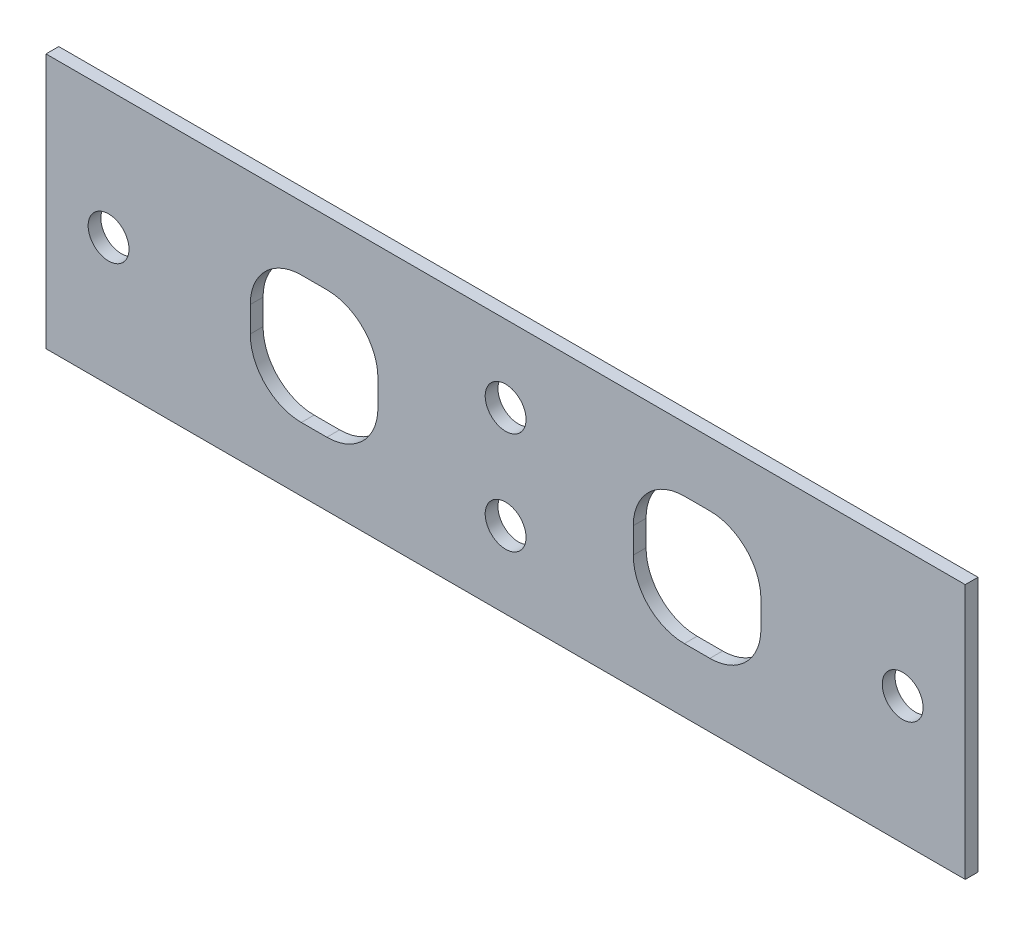
ISO-10303-21;
HEADER;
FILE_DESCRIPTION(('STEP AP214'),'2;1');
FILE_NAME('part.step','',(''),(''),'','','');
FILE_SCHEMA(('AUTOMOTIVE_DESIGN { 1 0 10303 214 1 1 1 1 }'));
ENDSEC;
DATA;
#1=APPLICATION_CONTEXT('core data for automotive mechanical design processes');
#2=APPLICATION_PROTOCOL_DEFINITION('international standard','automotive_design',2000,#1);
#3=PRODUCT_CONTEXT('',#1,'mechanical');
#4=PRODUCT('Part','Part','',(#3));
#5=PRODUCT_RELATED_PRODUCT_CATEGORY('part','',(#4));
#6=PRODUCT_DEFINITION_FORMATION('','',#4);
#7=PRODUCT_DEFINITION_CONTEXT('part definition',#1,'design');
#8=PRODUCT_DEFINITION('design','',#6,#7);
#9=PRODUCT_DEFINITION_SHAPE('','',#8);
#10=(LENGTH_UNIT() NAMED_UNIT(*) SI_UNIT(.MILLI.,.METRE.));
#11=(NAMED_UNIT(*) PLANE_ANGLE_UNIT() SI_UNIT($,.RADIAN.));
#12=(NAMED_UNIT(*) SI_UNIT($,.STERADIAN.) SOLID_ANGLE_UNIT());
#13=UNCERTAINTY_MEASURE_WITH_UNIT(LENGTH_MEASURE(1.E-05),#10,'distance_accuracy_value','');
#14=(GEOMETRIC_REPRESENTATION_CONTEXT(3) GLOBAL_UNCERTAINTY_ASSIGNED_CONTEXT((#13)) GLOBAL_UNIT_ASSIGNED_CONTEXT((#10,
#11,#12)) REPRESENTATION_CONTEXT('',''));
#15=CARTESIAN_POINT('',(0.,0.,0.));
#16=DIRECTION('',(0.,0.,1.));
#17=DIRECTION('',(1.,0.,0.));
#18=AXIS2_PLACEMENT_3D('',#15,#16,#17);
#19=CARTESIAN_POINT('',(0.,0.,0.));
#20=DIRECTION('',(0.,0.,1.));
#21=DIRECTION('',(1.,0.,0.));
#22=AXIS2_PLACEMENT_3D('',#19,#20,#21);
#23=PLANE('',#22);
#24=CARTESIAN_POINT('',(31.1,0.,0.));
#25=DIRECTION('',(0.,0.,1.));
#26=DIRECTION('',(1.,0.,0.));
#27=AXIS2_PLACEMENT_3D('',#24,#25,#26);
#28=CIRCLE('',#27,1.6);
#29=CARTESIAN_POINT('',(32.7,0.,0.));
#30=VERTEX_POINT('',#29);
#31=EDGE_CURVE('E247',#30,#30,#28,.T.);
#32=ORIENTED_EDGE('',*,*,#31,.T.);
#33=EDGE_LOOP('',(#32));
#34=FACE_BOUND('',#33,.T.);
#35=CARTESIAN_POINT('',(-31.1,0.,0.));
#36=DIRECTION('',(0.,0.,1.));
#37=DIRECTION('',(1.,0.,0.));
#38=AXIS2_PLACEMENT_3D('',#35,#36,#37);
#39=CIRCLE('',#38,1.6);
#40=CARTESIAN_POINT('',(-29.5,0.,0.));
#41=VERTEX_POINT('',#40);
#42=EDGE_CURVE('E251',#41,#41,#39,.T.);
#43=ORIENTED_EDGE('',*,*,#42,.T.);
#44=EDGE_LOOP('',(#43));
#45=FACE_BOUND('',#44,.T.);
#46=CARTESIAN_POINT('',(0.,4.,0.));
#47=DIRECTION('',(0.,0.,1.));
#48=DIRECTION('',(1.,0.,0.));
#49=AXIS2_PLACEMENT_3D('',#46,#47,#48);
#50=CIRCLE('',#49,1.6);
#51=CARTESIAN_POINT('',(1.6,4.,0.));
#52=VERTEX_POINT('',#51);
#53=EDGE_CURVE('E254',#52,#52,#50,.T.);
#54=ORIENTED_EDGE('',*,*,#53,.T.);
#55=EDGE_LOOP('',(#54));
#56=FACE_BOUND('',#55,.T.);
#57=CARTESIAN_POINT('',(0.,-4.,0.));
#58=DIRECTION('',(0.,0.,1.));
#59=DIRECTION('',(1.,0.,0.));
#60=AXIS2_PLACEMENT_3D('',#57,#58,#59);
#61=CIRCLE('',#60,1.6);
#62=CARTESIAN_POINT('',(1.6,-4.,0.));
#63=VERTEX_POINT('',#62);
#64=EDGE_CURVE('E257',#63,#63,#61,.T.);
#65=ORIENTED_EDGE('',*,*,#64,.T.);
#66=EDGE_LOOP('',(#65));
#67=FACE_BOUND('',#66,.T.);
#68=DIRECTION('',(0.,1.,0.));
#69=VECTOR('',#68,1.);
#70=CARTESIAN_POINT('',(10.,-1.,0.));
#71=LINE('',#70,#69);
#72=CARTESIAN_POINT('',(10.,1.,0.));
#73=VERTEX_POINT('',#72);
#74=CARTESIAN_POINT('',(10.,-1.,0.));
#75=VERTEX_POINT('',#74);
#76=EDGE_CURVE('E177',#73,#75,#71,.F.);
#77=ORIENTED_EDGE('',*,*,#76,.T.);
#78=CARTESIAN_POINT('',(14.,-1.,0.));
#79=DIRECTION('',(0.,0.,-1.));
#80=DIRECTION('',(-1.,0.,0.));
#81=AXIS2_PLACEMENT_3D('',#78,#79,#80);
#82=CIRCLE('',#81,4.);
#83=CARTESIAN_POINT('',(14.,-5.,0.));
#84=VERTEX_POINT('',#83);
#85=EDGE_CURVE('E260',#75,#84,#82,.F.);
#86=ORIENTED_EDGE('',*,*,#85,.T.);
#87=DIRECTION('',(1.,0.,0.));
#88=VECTOR('',#87,1.);
#89=CARTESIAN_POINT('',(16.,-5.,0.));
#90=LINE('',#89,#88);
#91=CARTESIAN_POINT('',(16.,-5.,0.));
#92=VERTEX_POINT('',#91);
#93=EDGE_CURVE('E180',#84,#92,#90,.T.);
#94=ORIENTED_EDGE('',*,*,#93,.T.);
#95=CARTESIAN_POINT('',(16.,-1.,0.));
#96=DIRECTION('',(0.,0.,-1.));
#97=DIRECTION('',(-1.,0.,0.));
#98=AXIS2_PLACEMENT_3D('',#95,#96,#97);
#99=CIRCLE('',#98,4.);
#100=CARTESIAN_POINT('',(20.,-1.,0.));
#101=VERTEX_POINT('',#100);
#102=EDGE_CURVE('E263',#92,#101,#99,.F.);
#103=ORIENTED_EDGE('',*,*,#102,.T.);
#104=DIRECTION('',(0.,1.,0.));
#105=VECTOR('',#104,1.);
#106=CARTESIAN_POINT('',(20.,0.999999999999998,0.));
#107=LINE('',#106,#105);
#108=CARTESIAN_POINT('',(20.,0.999999999999999,0.));
#109=VERTEX_POINT('',#108);
#110=EDGE_CURVE('E184',#101,#109,#107,.T.);
#111=ORIENTED_EDGE('',*,*,#110,.T.);
#112=CARTESIAN_POINT('',(16.,0.999999999999999,0.));
#113=DIRECTION('',(0.,0.,-1.));
#114=DIRECTION('',(-1.,0.,0.));
#115=AXIS2_PLACEMENT_3D('',#112,#113,#114);
#116=CIRCLE('',#115,4.);
#117=CARTESIAN_POINT('',(16.,5.,0.));
#118=VERTEX_POINT('',#117);
#119=EDGE_CURVE('E265',#109,#118,#116,.F.);
#120=ORIENTED_EDGE('',*,*,#119,.T.);
#121=DIRECTION('',(1.,0.,0.));
#122=VECTOR('',#121,1.);
#123=CARTESIAN_POINT('',(14.,5.,0.));
#124=LINE('',#123,#122);
#125=CARTESIAN_POINT('',(14.,5.,0.));
#126=VERTEX_POINT('',#125);
#127=EDGE_CURVE('E188',#118,#126,#124,.F.);
#128=ORIENTED_EDGE('',*,*,#127,.T.);
#129=CARTESIAN_POINT('',(14.,0.999999999999999,0.));
#130=DIRECTION('',(0.,0.,-1.));
#131=DIRECTION('',(-1.,0.,0.));
#132=AXIS2_PLACEMENT_3D('',#129,#130,#131);
#133=CIRCLE('',#132,4.);
#134=EDGE_CURVE('E191',#126,#73,#133,.F.);
#135=ORIENTED_EDGE('',*,*,#134,.T.);
#136=EDGE_LOOP('',(#77,#86,#94,#103,#111,#120,#128,#135));
#137=FACE_BOUND('',#136,.T.);
#138=DIRECTION('',(1.,0.,0.));
#139=VECTOR('',#138,1.);
#140=CARTESIAN_POINT('',(-14.,-5.,0.));
#141=LINE('',#140,#139);
#142=CARTESIAN_POINT('',(-16.,-5.,0.));
#143=VERTEX_POINT('',#142);
#144=CARTESIAN_POINT('',(-14.,-5.,0.));
#145=VERTEX_POINT('',#144);
#146=EDGE_CURVE('E192',#143,#145,#141,.T.);
#147=ORIENTED_EDGE('',*,*,#146,.T.);
#148=CARTESIAN_POINT('',(-14.,-1.,0.));
#149=DIRECTION('',(0.,0.,-1.));
#150=DIRECTION('',(-1.,0.,0.));
#151=AXIS2_PLACEMENT_3D('',#148,#149,#150);
#152=CIRCLE('',#151,4.);
#153=CARTESIAN_POINT('',(-10.,-1.,0.));
#154=VERTEX_POINT('',#153);
#155=EDGE_CURVE('E268',#145,#154,#152,.F.);
#156=ORIENTED_EDGE('',*,*,#155,.T.);
#157=DIRECTION('',(0.,1.,0.));
#158=VECTOR('',#157,1.);
#159=CARTESIAN_POINT('',(-10.,1.,0.));
#160=LINE('',#159,#158);
#161=CARTESIAN_POINT('',(-10.,1.,0.));
#162=VERTEX_POINT('',#161);
#163=EDGE_CURVE('E196',#154,#162,#160,.T.);
#164=ORIENTED_EDGE('',*,*,#163,.T.);
#165=CARTESIAN_POINT('',(-14.,0.999999999999999,0.));
#166=DIRECTION('',(0.,0.,-1.));
#167=DIRECTION('',(-1.,0.,0.));
#168=AXIS2_PLACEMENT_3D('',#165,#166,#167);
#169=CIRCLE('',#168,4.);
#170=CARTESIAN_POINT('',(-14.,5.,0.));
#171=VERTEX_POINT('',#170);
#172=EDGE_CURVE('E271',#162,#171,#169,.F.);
#173=ORIENTED_EDGE('',*,*,#172,.T.);
#174=DIRECTION('',(1.,0.,0.));
#175=VECTOR('',#174,1.);
#176=CARTESIAN_POINT('',(-16.,5.,0.));
#177=LINE('',#176,#175);
#178=CARTESIAN_POINT('',(-16.,5.,0.));
#179=VERTEX_POINT('',#178);
#180=EDGE_CURVE('E200',#171,#179,#177,.F.);
#181=ORIENTED_EDGE('',*,*,#180,.T.);
#182=CARTESIAN_POINT('',(-16.,0.999999999999999,0.));
#183=DIRECTION('',(0.,0.,-1.));
#184=DIRECTION('',(-1.,0.,0.));
#185=AXIS2_PLACEMENT_3D('',#182,#183,#184);
#186=CIRCLE('',#185,4.);
#187=CARTESIAN_POINT('',(-20.,0.999999999999999,0.));
#188=VERTEX_POINT('',#187);
#189=EDGE_CURVE('E272',#179,#188,#186,.F.);
#190=ORIENTED_EDGE('',*,*,#189,.T.);
#191=DIRECTION('',(0.,1.,0.));
#192=VECTOR('',#191,1.);
#193=CARTESIAN_POINT('',(-20.,-1.,0.));
#194=LINE('',#193,#192);
#195=CARTESIAN_POINT('',(-20.,-1.,0.));
#196=VERTEX_POINT('',#195);
#197=EDGE_CURVE('E131',#188,#196,#194,.F.);
#198=ORIENTED_EDGE('',*,*,#197,.T.);
#199=CARTESIAN_POINT('',(-16.,-1.,0.));
#200=DIRECTION('',(0.,0.,-1.));
#201=DIRECTION('',(-1.,0.,0.));
#202=AXIS2_PLACEMENT_3D('',#199,#200,#201);
#203=CIRCLE('',#202,4.);
#204=EDGE_CURVE('E19',#196,#143,#203,.F.);
#205=ORIENTED_EDGE('',*,*,#204,.T.);
#206=EDGE_LOOP('',(#147,#156,#164,#173,#181,#190,#198,#205));
#207=FACE_BOUND('',#206,.T.);
#208=DIRECTION('',(0.,1.,0.));
#209=VECTOR('',#208,1.);
#210=CARTESIAN_POINT('',(36.,10.,0.));
#211=LINE('',#210,#209);
#212=CARTESIAN_POINT('',(36.,-9.99999999999999,0.));
#213=VERTEX_POINT('',#212);
#214=CARTESIAN_POINT('',(36.,10.,0.));
#215=VERTEX_POINT('',#214);
#216=EDGE_CURVE('E140',#213,#215,#211,.T.);
#217=ORIENTED_EDGE('',*,*,#216,.F.);
#218=DIRECTION('',(1.,0.,0.));
#219=VECTOR('',#218,1.);
#220=CARTESIAN_POINT('',(36.,-10.,0.));
#221=LINE('',#220,#219);
#222=CARTESIAN_POINT('',(-36.,-9.99999999999999,0.));
#223=VERTEX_POINT('',#222);
#224=EDGE_CURVE('E282',#223,#213,#221,.T.);
#225=ORIENTED_EDGE('',*,*,#224,.F.);
#226=DIRECTION('',(0.,-1.,0.));
#227=VECTOR('',#226,1.);
#228=CARTESIAN_POINT('',(-36.,-9.99999999999999,0.));
#229=LINE('',#228,#227);
#230=CARTESIAN_POINT('',(-36.,9.99999999999999,0.));
#231=VERTEX_POINT('',#230);
#232=EDGE_CURVE('E164',#231,#223,#229,.T.);
#233=ORIENTED_EDGE('',*,*,#232,.F.);
#234=DIRECTION('',(-1.,0.,0.));
#235=VECTOR('',#234,1.);
#236=CARTESIAN_POINT('',(-36.,9.99999999999999,0.));
#237=LINE('',#236,#235);
#238=EDGE_CURVE('E163',#215,#231,#237,.T.);
#239=ORIENTED_EDGE('',*,*,#238,.F.);
#240=EDGE_LOOP('',(#217,#225,#233,#239));
#241=FACE_BOUND('',#240,.T.);
#242=ADVANCED_FACE('F16',(#34,#45,#56,#67,#137,#207,#241),#23,.F.);
#243=CARTESIAN_POINT('',(36.,10.,0.));
#244=DIRECTION('',(1.,0.,0.));
#245=DIRECTION('',(0.,1.,0.));
#246=AXIS2_PLACEMENT_3D('',#243,#244,#245);
#247=PLANE('',#246);
#248=ORIENTED_EDGE('',*,*,#216,.T.);
#249=DIRECTION('',(0.,0.,1.));
#250=VECTOR('',#249,1.);
#251=CARTESIAN_POINT('',(36.,9.99999999999999,0.));
#252=LINE('',#251,#250);
#253=CARTESIAN_POINT('',(36.,10.,1.));
#254=VERTEX_POINT('',#253);
#255=EDGE_CURVE('E156',#254,#215,#252,.F.);
#256=ORIENTED_EDGE('',*,*,#255,.F.);
#257=DIRECTION('',(0.,1.,0.));
#258=VECTOR('',#257,1.);
#259=CARTESIAN_POINT('',(36.,0.,1.));
#260=LINE('',#259,#258);
#261=CARTESIAN_POINT('',(36.,-10.,1.));
#262=VERTEX_POINT('',#261);
#263=EDGE_CURVE('E250',#262,#254,#260,.T.);
#264=ORIENTED_EDGE('',*,*,#263,.F.);
#265=DIRECTION('',(0.,0.,1.));
#266=VECTOR('',#265,1.);
#267=CARTESIAN_POINT('',(36.,-10.,0.));
#268=LINE('',#267,#266);
#269=EDGE_CURVE('E159',#213,#262,#268,.T.);
#270=ORIENTED_EDGE('',*,*,#269,.F.);
#271=EDGE_LOOP('',(#248,#256,#264,#270));
#272=FACE_BOUND('',#271,.T.);
#273=ADVANCED_FACE('F153',(#272),#247,.T.);
#274=CARTESIAN_POINT('',(-36.,9.99999999999999,0.));
#275=DIRECTION('',(0.,1.,0.));
#276=DIRECTION('',(-1.,0.,0.));
#277=AXIS2_PLACEMENT_3D('',#274,#275,#276);
#278=PLANE('',#277);
#279=ORIENTED_EDGE('',*,*,#238,.T.);
#280=DIRECTION('',(0.,0.,1.));
#281=VECTOR('',#280,1.);
#282=CARTESIAN_POINT('',(-36.,9.99999999999999,0.));
#283=LINE('',#282,#281);
#284=CARTESIAN_POINT('',(-36.,9.99999999999999,1.));
#285=VERTEX_POINT('',#284);
#286=EDGE_CURVE('E168',#285,#231,#283,.F.);
#287=ORIENTED_EDGE('',*,*,#286,.F.);
#288=DIRECTION('',(1.,0.,0.));
#289=VECTOR('',#288,1.);
#290=CARTESIAN_POINT('',(0.,10.,1.));
#291=LINE('',#290,#289);
#292=EDGE_CURVE('E172',#254,#285,#291,.F.);
#293=ORIENTED_EDGE('',*,*,#292,.F.);
#294=ORIENTED_EDGE('',*,*,#255,.T.);
#295=EDGE_LOOP('',(#279,#287,#293,#294));
#296=FACE_BOUND('',#295,.T.);
#297=ADVANCED_FACE('F170',(#296),#278,.T.);
#298=CARTESIAN_POINT('',(-36.,-9.99999999999999,0.));
#299=DIRECTION('',(-1.,0.,0.));
#300=DIRECTION('',(0.,-1.,0.));
#301=AXIS2_PLACEMENT_3D('',#298,#299,#300);
#302=PLANE('',#301);
#303=ORIENTED_EDGE('',*,*,#232,.T.);
#304=DIRECTION('',(0.,0.,1.));
#305=VECTOR('',#304,1.);
#306=CARTESIAN_POINT('',(-36.,-9.99999999999999,0.));
#307=LINE('',#306,#305);
#308=CARTESIAN_POINT('',(-36.,-9.99999999999999,1.));
#309=VERTEX_POINT('',#308);
#310=EDGE_CURVE('E284',#309,#223,#307,.F.);
#311=ORIENTED_EDGE('',*,*,#310,.F.);
#312=DIRECTION('',(0.,1.,0.));
#313=VECTOR('',#312,1.);
#314=CARTESIAN_POINT('',(-36.,0.,1.));
#315=LINE('',#314,#313);
#316=EDGE_CURVE('E293',#285,#309,#315,.F.);
#317=ORIENTED_EDGE('',*,*,#316,.F.);
#318=ORIENTED_EDGE('',*,*,#286,.T.);
#319=EDGE_LOOP('',(#303,#311,#317,#318));
#320=FACE_BOUND('',#319,.T.);
#321=ADVANCED_FACE('F289',(#320),#302,.T.);
#322=CARTESIAN_POINT('',(36.,-10.,0.));
#323=DIRECTION('',(0.,-1.,0.));
#324=DIRECTION('',(1.,0.,0.));
#325=AXIS2_PLACEMENT_3D('',#322,#323,#324);
#326=PLANE('',#325);
#327=ORIENTED_EDGE('',*,*,#224,.T.);
#328=ORIENTED_EDGE('',*,*,#269,.T.);
#329=DIRECTION('',(1.,0.,0.));
#330=VECTOR('',#329,1.);
#331=CARTESIAN_POINT('',(0.,-9.99999999999999,1.));
#332=LINE('',#331,#330);
#333=EDGE_CURVE('E246',#309,#262,#332,.T.);
#334=ORIENTED_EDGE('',*,*,#333,.F.);
#335=ORIENTED_EDGE('',*,*,#310,.T.);
#336=EDGE_LOOP('',(#327,#328,#334,#335));
#337=FACE_BOUND('',#336,.T.);
#338=ADVANCED_FACE('F301',(#337),#326,.T.);
#339=CARTESIAN_POINT('',(-16.,-1.,1.));
#340=DIRECTION('',(0.,0.,-1.));
#341=DIRECTION('',(-1.,0.,0.));
#342=AXIS2_PLACEMENT_3D('',#339,#340,#341);
#343=CYLINDRICAL_SURFACE('',#342,4.);
#344=DIRECTION('',(0.,0.,1.));
#345=VECTOR('',#344,1.);
#346=CARTESIAN_POINT('',(-16.,-5.,1.));
#347=LINE('',#346,#345);
#348=CARTESIAN_POINT('',(-16.,-5.,1.));
#349=VERTEX_POINT('',#348);
#350=EDGE_CURVE('E195',#349,#143,#347,.F.);
#351=ORIENTED_EDGE('',*,*,#350,.T.);
#352=ORIENTED_EDGE('',*,*,#204,.F.);
#353=DIRECTION('',(0.,0.,1.));
#354=VECTOR('',#353,1.);
#355=CARTESIAN_POINT('',(-20.,-1.,1.));
#356=LINE('',#355,#354);
#357=CARTESIAN_POINT('',(-20.,-1.,1.));
#358=VERTEX_POINT('',#357);
#359=EDGE_CURVE('E204',#196,#358,#356,.T.);
#360=ORIENTED_EDGE('',*,*,#359,.T.);
#361=CARTESIAN_POINT('',(-16.,-1.,1.));
#362=DIRECTION('',(0.,0.,-1.));
#363=DIRECTION('',(-1.,0.,0.));
#364=AXIS2_PLACEMENT_3D('',#361,#362,#363);
#365=CIRCLE('',#364,4.);
#366=EDGE_CURVE('E243',#349,#358,#365,.T.);
#367=ORIENTED_EDGE('',*,*,#366,.F.);
#368=EDGE_LOOP('',(#351,#352,#360,#367));
#369=FACE_BOUND('',#368,.T.);
#370=ADVANCED_FACE('F341',(#369),#343,.F.);
#371=CARTESIAN_POINT('',(-20.,-1.,1.));
#372=DIRECTION('',(-1.,0.,0.));
#373=DIRECTION('',(0.,0.,1.));
#374=AXIS2_PLACEMENT_3D('',#371,#372,#373);
#375=PLANE('',#374);
#376=ORIENTED_EDGE('',*,*,#359,.F.);
#377=ORIENTED_EDGE('',*,*,#197,.F.);
#378=DIRECTION('',(0.,0.,-1.));
#379=VECTOR('',#378,1.);
#380=CARTESIAN_POINT('',(-20.,0.999999999999999,1.));
#381=LINE('',#380,#379);
#382=CARTESIAN_POINT('',(-20.,0.999999999999999,1.));
#383=VERTEX_POINT('',#382);
#384=EDGE_CURVE('E203',#188,#383,#381,.F.);
#385=ORIENTED_EDGE('',*,*,#384,.T.);
#386=DIRECTION('',(0.,1.,0.));
#387=VECTOR('',#386,1.);
#388=CARTESIAN_POINT('',(-20.,0.,1.));
#389=LINE('',#388,#387);
#390=EDGE_CURVE('E242',#358,#383,#389,.T.);
#391=ORIENTED_EDGE('',*,*,#390,.F.);
#392=EDGE_LOOP('',(#376,#377,#385,#391));
#393=FACE_BOUND('',#392,.T.);
#394=ADVANCED_FACE('F339',(#393),#375,.F.);
#395=CARTESIAN_POINT('',(-16.,0.999999999999999,1.));
#396=DIRECTION('',(0.,0.,-1.));
#397=DIRECTION('',(-1.,0.,0.));
#398=AXIS2_PLACEMENT_3D('',#395,#396,#397);
#399=CYLINDRICAL_SURFACE('',#398,4.);
#400=ORIENTED_EDGE('',*,*,#384,.F.);
#401=ORIENTED_EDGE('',*,*,#189,.F.);
#402=DIRECTION('',(0.,0.,1.));
#403=VECTOR('',#402,1.);
#404=CARTESIAN_POINT('',(-16.,5.,1.));
#405=LINE('',#404,#403);
#406=CARTESIAN_POINT('',(-16.,5.,1.));
#407=VERTEX_POINT('',#406);
#408=EDGE_CURVE('E202',#179,#407,#405,.T.);
#409=ORIENTED_EDGE('',*,*,#408,.T.);
#410=CARTESIAN_POINT('',(-16.,0.999999999999999,1.));
#411=DIRECTION('',(0.,0.,-1.));
#412=DIRECTION('',(-1.,0.,0.));
#413=AXIS2_PLACEMENT_3D('',#410,#411,#412);
#414=CIRCLE('',#413,4.);
#415=EDGE_CURVE('E239',#383,#407,#414,.T.);
#416=ORIENTED_EDGE('',*,*,#415,.F.);
#417=EDGE_LOOP('',(#400,#401,#409,#416));
#418=FACE_BOUND('',#417,.T.);
#419=ADVANCED_FACE('F328',(#418),#399,.F.);
#420=CARTESIAN_POINT('',(-16.,5.,1.));
#421=DIRECTION('',(0.,1.,0.));
#422=DIRECTION('',(0.,0.,1.));
#423=AXIS2_PLACEMENT_3D('',#420,#421,#422);
#424=PLANE('',#423);
#425=ORIENTED_EDGE('',*,*,#408,.F.);
#426=ORIENTED_EDGE('',*,*,#180,.F.);
#427=DIRECTION('',(0.,0.,-1.));
#428=VECTOR('',#427,1.);
#429=CARTESIAN_POINT('',(-14.,5.,1.));
#430=LINE('',#429,#428);
#431=CARTESIAN_POINT('',(-14.,5.,1.));
#432=VERTEX_POINT('',#431);
#433=EDGE_CURVE('E199',#171,#432,#430,.F.);
#434=ORIENTED_EDGE('',*,*,#433,.T.);
#435=DIRECTION('',(1.,0.,0.));
#436=VECTOR('',#435,1.);
#437=CARTESIAN_POINT('',(0.,5.,1.));
#438=LINE('',#437,#436);
#439=EDGE_CURVE('E238',#407,#432,#438,.T.);
#440=ORIENTED_EDGE('',*,*,#439,.F.);
#441=EDGE_LOOP('',(#425,#426,#434,#440));
#442=FACE_BOUND('',#441,.T.);
#443=ADVANCED_FACE('F333',(#442),#424,.F.);
#444=CARTESIAN_POINT('',(-14.,0.999999999999999,1.));
#445=DIRECTION('',(0.,0.,-1.));
#446=DIRECTION('',(-1.,0.,0.));
#447=AXIS2_PLACEMENT_3D('',#444,#445,#446);
#448=CYLINDRICAL_SURFACE('',#447,4.);
#449=ORIENTED_EDGE('',*,*,#433,.F.);
#450=ORIENTED_EDGE('',*,*,#172,.F.);
#451=DIRECTION('',(0.,0.,-1.));
#452=VECTOR('',#451,1.);
#453=CARTESIAN_POINT('',(-10.,1.,1.));
#454=LINE('',#453,#452);
#455=CARTESIAN_POINT('',(-10.,1.,1.));
#456=VERTEX_POINT('',#455);
#457=EDGE_CURVE('E198',#162,#456,#454,.F.);
#458=ORIENTED_EDGE('',*,*,#457,.T.);
#459=CARTESIAN_POINT('',(-14.,0.999999999999999,1.));
#460=DIRECTION('',(0.,0.,-1.));
#461=DIRECTION('',(-1.,0.,0.));
#462=AXIS2_PLACEMENT_3D('',#459,#460,#461);
#463=CIRCLE('',#462,4.);
#464=EDGE_CURVE('E235',#432,#456,#463,.T.);
#465=ORIENTED_EDGE('',*,*,#464,.F.);
#466=EDGE_LOOP('',(#449,#450,#458,#465));
#467=FACE_BOUND('',#466,.T.);
#468=ADVANCED_FACE('F415',(#467),#448,.F.);
#469=CARTESIAN_POINT('',(-10.,1.,1.));
#470=DIRECTION('',(1.,0.,0.));
#471=DIRECTION('',(0.,0.,-1.));
#472=AXIS2_PLACEMENT_3D('',#469,#470,#471);
#473=PLANE('',#472);
#474=ORIENTED_EDGE('',*,*,#457,.F.);
#475=ORIENTED_EDGE('',*,*,#163,.F.);
#476=DIRECTION('',(0.,0.,-1.));
#477=VECTOR('',#476,1.);
#478=CARTESIAN_POINT('',(-10.,-1.,1.));
#479=LINE('',#478,#477);
#480=CARTESIAN_POINT('',(-10.,-1.,1.));
#481=VERTEX_POINT('',#480);
#482=EDGE_CURVE('E270',#154,#481,#479,.F.);
#483=ORIENTED_EDGE('',*,*,#482,.T.);
#484=DIRECTION('',(0.,1.,0.));
#485=VECTOR('',#484,1.);
#486=CARTESIAN_POINT('',(-10.,0.,1.));
#487=LINE('',#486,#485);
#488=EDGE_CURVE('E234',#456,#481,#487,.F.);
#489=ORIENTED_EDGE('',*,*,#488,.F.);
#490=EDGE_LOOP('',(#474,#475,#483,#489));
#491=FACE_BOUND('',#490,.T.);
#492=ADVANCED_FACE('F411',(#491),#473,.F.);
#493=CARTESIAN_POINT('',(-14.,-1.,1.));
#494=DIRECTION('',(0.,0.,-1.));
#495=DIRECTION('',(-1.,0.,0.));
#496=AXIS2_PLACEMENT_3D('',#493,#494,#495);
#497=CYLINDRICAL_SURFACE('',#496,4.);
#498=ORIENTED_EDGE('',*,*,#482,.F.);
#499=ORIENTED_EDGE('',*,*,#155,.F.);
#500=DIRECTION('',(0.,0.,1.));
#501=VECTOR('',#500,1.);
#502=CARTESIAN_POINT('',(-14.,-5.,1.));
#503=LINE('',#502,#501);
#504=CARTESIAN_POINT('',(-14.,-5.,1.));
#505=VERTEX_POINT('',#504);
#506=EDGE_CURVE('E194',#145,#505,#503,.T.);
#507=ORIENTED_EDGE('',*,*,#506,.T.);
#508=CARTESIAN_POINT('',(-14.,-1.,1.));
#509=DIRECTION('',(0.,0.,-1.));
#510=DIRECTION('',(-1.,0.,0.));
#511=AXIS2_PLACEMENT_3D('',#508,#509,#510);
#512=CIRCLE('',#511,4.);
#513=EDGE_CURVE('E231',#481,#505,#512,.T.);
#514=ORIENTED_EDGE('',*,*,#513,.F.);
#515=EDGE_LOOP('',(#498,#499,#507,#514));
#516=FACE_BOUND('',#515,.T.);
#517=ADVANCED_FACE('F407',(#516),#497,.F.);
#518=CARTESIAN_POINT('',(-14.,-5.,1.));
#519=DIRECTION('',(0.,-1.,0.));
#520=DIRECTION('',(1.,0.,0.));
#521=AXIS2_PLACEMENT_3D('',#518,#519,#520);
#522=PLANE('',#521);
#523=ORIENTED_EDGE('',*,*,#506,.F.);
#524=ORIENTED_EDGE('',*,*,#146,.F.);
#525=ORIENTED_EDGE('',*,*,#350,.F.);
#526=DIRECTION('',(1.,0.,0.));
#527=VECTOR('',#526,1.);
#528=CARTESIAN_POINT('',(0.,-5.,1.));
#529=LINE('',#528,#527);
#530=EDGE_CURVE('E230',#505,#349,#529,.F.);
#531=ORIENTED_EDGE('',*,*,#530,.F.);
#532=EDGE_LOOP('',(#523,#524,#525,#531));
#533=FACE_BOUND('',#532,.T.);
#534=ADVANCED_FACE('F403',(#533),#522,.F.);
#535=CARTESIAN_POINT('',(14.,0.999999999999999,1.));
#536=DIRECTION('',(0.,0.,-1.));
#537=DIRECTION('',(-1.,0.,0.));
#538=AXIS2_PLACEMENT_3D('',#535,#536,#537);
#539=CYLINDRICAL_SURFACE('',#538,4.);
#540=DIRECTION('',(0.,0.,1.));
#541=VECTOR('',#540,1.);
#542=CARTESIAN_POINT('',(10.,1.,1.));
#543=LINE('',#542,#541);
#544=CARTESIAN_POINT('',(10.,1.,1.));
#545=VERTEX_POINT('',#544);
#546=EDGE_CURVE('E179',#545,#73,#543,.F.);
#547=ORIENTED_EDGE('',*,*,#546,.T.);
#548=ORIENTED_EDGE('',*,*,#134,.F.);
#549=DIRECTION('',(0.,0.,1.));
#550=VECTOR('',#549,1.);
#551=CARTESIAN_POINT('',(14.,5.,1.));
#552=LINE('',#551,#550);
#553=CARTESIAN_POINT('',(14.,5.,1.));
#554=VERTEX_POINT('',#553);
#555=EDGE_CURVE('E190',#126,#554,#552,.T.);
#556=ORIENTED_EDGE('',*,*,#555,.T.);
#557=CARTESIAN_POINT('',(14.,0.999999999999999,1.));
#558=DIRECTION('',(0.,0.,-1.));
#559=DIRECTION('',(-1.,0.,0.));
#560=AXIS2_PLACEMENT_3D('',#557,#558,#559);
#561=CIRCLE('',#560,4.);
#562=EDGE_CURVE('E227',#545,#554,#561,.T.);
#563=ORIENTED_EDGE('',*,*,#562,.F.);
#564=EDGE_LOOP('',(#547,#548,#556,#563));
#565=FACE_BOUND('',#564,.T.);
#566=ADVANCED_FACE('F399',(#565),#539,.F.);
#567=CARTESIAN_POINT('',(14.,5.,1.));
#568=DIRECTION('',(0.,1.,0.));
#569=DIRECTION('',(0.,0.,1.));
#570=AXIS2_PLACEMENT_3D('',#567,#568,#569);
#571=PLANE('',#570);
#572=ORIENTED_EDGE('',*,*,#555,.F.);
#573=ORIENTED_EDGE('',*,*,#127,.F.);
#574=DIRECTION('',(0.,0.,-1.));
#575=VECTOR('',#574,1.);
#576=CARTESIAN_POINT('',(16.,5.,1.));
#577=LINE('',#576,#575);
#578=CARTESIAN_POINT('',(16.,5.,1.));
#579=VERTEX_POINT('',#578);
#580=EDGE_CURVE('E187',#118,#579,#577,.F.);
#581=ORIENTED_EDGE('',*,*,#580,.T.);
#582=DIRECTION('',(1.,0.,0.));
#583=VECTOR('',#582,1.);
#584=CARTESIAN_POINT('',(0.,5.,1.));
#585=LINE('',#584,#583);
#586=EDGE_CURVE('E226',#554,#579,#585,.T.);
#587=ORIENTED_EDGE('',*,*,#586,.F.);
#588=EDGE_LOOP('',(#572,#573,#581,#587));
#589=FACE_BOUND('',#588,.T.);
#590=ADVANCED_FACE('F395',(#589),#571,.F.);
#591=CARTESIAN_POINT('',(16.,0.999999999999999,1.));
#592=DIRECTION('',(0.,0.,-1.));
#593=DIRECTION('',(-1.,0.,0.));
#594=AXIS2_PLACEMENT_3D('',#591,#592,#593);
#595=CYLINDRICAL_SURFACE('',#594,4.);
#596=ORIENTED_EDGE('',*,*,#580,.F.);
#597=ORIENTED_EDGE('',*,*,#119,.F.);
#598=DIRECTION('',(0.,0.,-1.));
#599=VECTOR('',#598,1.);
#600=CARTESIAN_POINT('',(20.,0.999999999999999,1.));
#601=LINE('',#600,#599);
#602=CARTESIAN_POINT('',(20.,0.999999999999999,1.));
#603=VERTEX_POINT('',#602);
#604=EDGE_CURVE('E186',#109,#603,#601,.F.);
#605=ORIENTED_EDGE('',*,*,#604,.T.);
#606=CARTESIAN_POINT('',(16.,0.999999999999999,1.));
#607=DIRECTION('',(0.,0.,-1.));
#608=DIRECTION('',(-1.,0.,0.));
#609=AXIS2_PLACEMENT_3D('',#606,#607,#608);
#610=CIRCLE('',#609,4.);
#611=EDGE_CURVE('E223',#579,#603,#610,.T.);
#612=ORIENTED_EDGE('',*,*,#611,.F.);
#613=EDGE_LOOP('',(#596,#597,#605,#612));
#614=FACE_BOUND('',#613,.T.);
#615=ADVANCED_FACE('F391',(#614),#595,.F.);
#616=CARTESIAN_POINT('',(20.,0.999999999999998,1.));
#617=DIRECTION('',(1.,0.,0.));
#618=DIRECTION('',(0.,0.,-1.));
#619=AXIS2_PLACEMENT_3D('',#616,#617,#618);
#620=PLANE('',#619);
#621=ORIENTED_EDGE('',*,*,#604,.F.);
#622=ORIENTED_EDGE('',*,*,#110,.F.);
#623=DIRECTION('',(0.,0.,-1.));
#624=VECTOR('',#623,1.);
#625=CARTESIAN_POINT('',(20.,-1.,1.));
#626=LINE('',#625,#624);
#627=CARTESIAN_POINT('',(20.,-1.,1.));
#628=VERTEX_POINT('',#627);
#629=EDGE_CURVE('E183',#101,#628,#626,.F.);
#630=ORIENTED_EDGE('',*,*,#629,.T.);
#631=DIRECTION('',(0.,1.,0.));
#632=VECTOR('',#631,1.);
#633=CARTESIAN_POINT('',(20.,0.,1.));
#634=LINE('',#633,#632);
#635=EDGE_CURVE('E222',#603,#628,#634,.F.);
#636=ORIENTED_EDGE('',*,*,#635,.F.);
#637=EDGE_LOOP('',(#621,#622,#630,#636));
#638=FACE_BOUND('',#637,.T.);
#639=ADVANCED_FACE('F387',(#638),#620,.F.);
#640=CARTESIAN_POINT('',(16.,-1.,1.));
#641=DIRECTION('',(0.,0.,-1.));
#642=DIRECTION('',(-1.,0.,0.));
#643=AXIS2_PLACEMENT_3D('',#640,#641,#642);
#644=CYLINDRICAL_SURFACE('',#643,4.);
#645=ORIENTED_EDGE('',*,*,#629,.F.);
#646=ORIENTED_EDGE('',*,*,#102,.F.);
#647=DIRECTION('',(0.,0.,1.));
#648=VECTOR('',#647,1.);
#649=CARTESIAN_POINT('',(16.,-5.,1.));
#650=LINE('',#649,#648);
#651=CARTESIAN_POINT('',(16.,-5.,1.));
#652=VERTEX_POINT('',#651);
#653=EDGE_CURVE('E182',#92,#652,#650,.T.);
#654=ORIENTED_EDGE('',*,*,#653,.T.);
#655=CARTESIAN_POINT('',(16.,-1.,1.));
#656=DIRECTION('',(0.,0.,-1.));
#657=DIRECTION('',(-1.,0.,0.));
#658=AXIS2_PLACEMENT_3D('',#655,#656,#657);
#659=CIRCLE('',#658,4.);
#660=EDGE_CURVE('E219',#628,#652,#659,.T.);
#661=ORIENTED_EDGE('',*,*,#660,.F.);
#662=EDGE_LOOP('',(#645,#646,#654,#661));
#663=FACE_BOUND('',#662,.T.);
#664=ADVANCED_FACE('F383',(#663),#644,.F.);
#665=CARTESIAN_POINT('',(16.,-5.,1.));
#666=DIRECTION('',(0.,-1.,0.));
#667=DIRECTION('',(1.,0.,0.));
#668=AXIS2_PLACEMENT_3D('',#665,#666,#667);
#669=PLANE('',#668);
#670=ORIENTED_EDGE('',*,*,#653,.F.);
#671=ORIENTED_EDGE('',*,*,#93,.F.);
#672=DIRECTION('',(0.,0.,-1.));
#673=VECTOR('',#672,1.);
#674=CARTESIAN_POINT('',(14.,-5.,1.));
#675=LINE('',#674,#673);
#676=CARTESIAN_POINT('',(14.,-5.,1.));
#677=VERTEX_POINT('',#676);
#678=EDGE_CURVE('E262',#84,#677,#675,.F.);
#679=ORIENTED_EDGE('',*,*,#678,.T.);
#680=DIRECTION('',(1.,0.,0.));
#681=VECTOR('',#680,1.);
#682=CARTESIAN_POINT('',(0.,-5.,1.));
#683=LINE('',#682,#681);
#684=EDGE_CURVE('E218',#652,#677,#683,.F.);
#685=ORIENTED_EDGE('',*,*,#684,.F.);
#686=EDGE_LOOP('',(#670,#671,#679,#685));
#687=FACE_BOUND('',#686,.T.);
#688=ADVANCED_FACE('F380',(#687),#669,.F.);
#689=CARTESIAN_POINT('',(14.,-1.,1.));
#690=DIRECTION('',(0.,0.,-1.));
#691=DIRECTION('',(-1.,0.,0.));
#692=AXIS2_PLACEMENT_3D('',#689,#690,#691);
#693=CYLINDRICAL_SURFACE('',#692,4.);
#694=ORIENTED_EDGE('',*,*,#678,.F.);
#695=ORIENTED_EDGE('',*,*,#85,.F.);
#696=DIRECTION('',(0.,0.,1.));
#697=VECTOR('',#696,1.);
#698=CARTESIAN_POINT('',(10.,-1.,1.));
#699=LINE('',#698,#697);
#700=CARTESIAN_POINT('',(10.,-1.,1.));
#701=VERTEX_POINT('',#700);
#702=EDGE_CURVE('E34',#75,#701,#699,.T.);
#703=ORIENTED_EDGE('',*,*,#702,.T.);
#704=CARTESIAN_POINT('',(14.,-1.,1.));
#705=DIRECTION('',(0.,0.,-1.));
#706=DIRECTION('',(-1.,0.,0.));
#707=AXIS2_PLACEMENT_3D('',#704,#705,#706);
#708=CIRCLE('',#707,4.);
#709=EDGE_CURVE('E215',#677,#701,#708,.T.);
#710=ORIENTED_EDGE('',*,*,#709,.F.);
#711=EDGE_LOOP('',(#694,#695,#703,#710));
#712=FACE_BOUND('',#711,.T.);
#713=ADVANCED_FACE('F376',(#712),#693,.F.);
#714=CARTESIAN_POINT('',(10.,-1.,1.));
#715=DIRECTION('',(-1.,0.,0.));
#716=DIRECTION('',(0.,0.,1.));
#717=AXIS2_PLACEMENT_3D('',#714,#715,#716);
#718=PLANE('',#717);
#719=ORIENTED_EDGE('',*,*,#702,.F.);
#720=ORIENTED_EDGE('',*,*,#76,.F.);
#721=ORIENTED_EDGE('',*,*,#546,.F.);
#722=DIRECTION('',(0.,1.,0.));
#723=VECTOR('',#722,1.);
#724=CARTESIAN_POINT('',(10.,0.,1.));
#725=LINE('',#724,#723);
#726=EDGE_CURVE('E214',#701,#545,#725,.T.);
#727=ORIENTED_EDGE('',*,*,#726,.F.);
#728=EDGE_LOOP('',(#719,#720,#721,#727));
#729=FACE_BOUND('',#728,.T.);
#730=ADVANCED_FACE('F372',(#729),#718,.F.);
#731=CARTESIAN_POINT('',(0.,-4.,0.));
#732=DIRECTION('',(0.,0.,1.));
#733=DIRECTION('',(1.,0.,0.));
#734=AXIS2_PLACEMENT_3D('',#731,#732,#733);
#735=CYLINDRICAL_SURFACE('',#734,1.6);
#736=CARTESIAN_POINT('',(0.,-4.,1.));
#737=DIRECTION('',(0.,0.,1.));
#738=DIRECTION('',(1.,0.,0.));
#739=AXIS2_PLACEMENT_3D('',#736,#737,#738);
#740=CIRCLE('',#739,1.6);
#741=CARTESIAN_POINT('',(1.6,-4.,1.));
#742=VERTEX_POINT('',#741);
#743=EDGE_CURVE('E211',#742,#742,#740,.F.);
#744=ORIENTED_EDGE('',*,*,#743,.F.);
#745=EDGE_LOOP('',(#744));
#746=FACE_BOUND('',#745,.T.);
#747=ORIENTED_EDGE('',*,*,#64,.F.);
#748=EDGE_LOOP('',(#747));
#749=FACE_BOUND('',#748,.T.);
#750=ADVANCED_FACE('F368',(#746,#749),#735,.F.);
#751=CARTESIAN_POINT('',(0.,4.,0.));
#752=DIRECTION('',(0.,0.,1.));
#753=DIRECTION('',(1.,0.,0.));
#754=AXIS2_PLACEMENT_3D('',#751,#752,#753);
#755=CYLINDRICAL_SURFACE('',#754,1.6);
#756=CARTESIAN_POINT('',(0.,4.,1.));
#757=DIRECTION('',(0.,0.,1.));
#758=DIRECTION('',(1.,0.,0.));
#759=AXIS2_PLACEMENT_3D('',#756,#757,#758);
#760=CIRCLE('',#759,1.6);
#761=CARTESIAN_POINT('',(1.6,4.,1.));
#762=VERTEX_POINT('',#761);
#763=EDGE_CURVE('E208',#762,#762,#760,.F.);
#764=ORIENTED_EDGE('',*,*,#763,.F.);
#765=EDGE_LOOP('',(#764));
#766=FACE_BOUND('',#765,.T.);
#767=ORIENTED_EDGE('',*,*,#53,.F.);
#768=EDGE_LOOP('',(#767));
#769=FACE_BOUND('',#768,.T.);
#770=ADVANCED_FACE('F364',(#766,#769),#755,.F.);
#771=CARTESIAN_POINT('',(-31.1,0.,0.));
#772=DIRECTION('',(0.,0.,1.));
#773=DIRECTION('',(1.,0.,0.));
#774=AXIS2_PLACEMENT_3D('',#771,#772,#773);
#775=CYLINDRICAL_SURFACE('',#774,1.6);
#776=CARTESIAN_POINT('',(-31.1,0.,1.));
#777=DIRECTION('',(0.,0.,1.));
#778=DIRECTION('',(1.,0.,0.));
#779=AXIS2_PLACEMENT_3D('',#776,#777,#778);
#780=CIRCLE('',#779,1.6);
#781=CARTESIAN_POINT('',(-29.5,0.,1.));
#782=VERTEX_POINT('',#781);
#783=EDGE_CURVE('E25',#782,#782,#780,.F.);
#784=ORIENTED_EDGE('',*,*,#783,.F.);
#785=EDGE_LOOP('',(#784));
#786=FACE_BOUND('',#785,.T.);
#787=ORIENTED_EDGE('',*,*,#42,.F.);
#788=EDGE_LOOP('',(#787));
#789=FACE_BOUND('',#788,.T.);
#790=ADVANCED_FACE('F357',(#786,#789),#775,.F.);
#791=CARTESIAN_POINT('',(31.1,0.,0.));
#792=DIRECTION('',(0.,0.,1.));
#793=DIRECTION('',(1.,0.,0.));
#794=AXIS2_PLACEMENT_3D('',#791,#792,#793);
#795=CYLINDRICAL_SURFACE('',#794,1.6);
#796=CARTESIAN_POINT('',(31.1,0.,1.));
#797=DIRECTION('',(0.,0.,1.));
#798=DIRECTION('',(1.,0.,0.));
#799=AXIS2_PLACEMENT_3D('',#796,#797,#798);
#800=CIRCLE('',#799,1.6);
#801=CARTESIAN_POINT('',(32.7,0.,1.));
#802=VERTEX_POINT('',#801);
#803=EDGE_CURVE('E11',#802,#802,#800,.F.);
#804=ORIENTED_EDGE('',*,*,#803,.F.);
#805=EDGE_LOOP('',(#804));
#806=FACE_BOUND('',#805,.T.);
#807=ORIENTED_EDGE('',*,*,#31,.F.);
#808=EDGE_LOOP('',(#807));
#809=FACE_BOUND('',#808,.T.);
#810=ADVANCED_FACE('F351',(#806,#809),#795,.F.);
#811=CARTESIAN_POINT('',(0.,0.,1.));
#812=DIRECTION('',(0.,0.,1.));
#813=DIRECTION('',(1.,0.,0.));
#814=AXIS2_PLACEMENT_3D('',#811,#812,#813);
#815=PLANE('',#814);
#816=ORIENTED_EDGE('',*,*,#803,.T.);
#817=EDGE_LOOP('',(#816));
#818=FACE_BOUND('',#817,.T.);
#819=ORIENTED_EDGE('',*,*,#783,.T.);
#820=EDGE_LOOP('',(#819));
#821=FACE_BOUND('',#820,.T.);
#822=ORIENTED_EDGE('',*,*,#763,.T.);
#823=EDGE_LOOP('',(#822));
#824=FACE_BOUND('',#823,.T.);
#825=ORIENTED_EDGE('',*,*,#743,.T.);
#826=EDGE_LOOP('',(#825));
#827=FACE_BOUND('',#826,.T.);
#828=ORIENTED_EDGE('',*,*,#709,.T.);
#829=ORIENTED_EDGE('',*,*,#726,.T.);
#830=ORIENTED_EDGE('',*,*,#562,.T.);
#831=ORIENTED_EDGE('',*,*,#586,.T.);
#832=ORIENTED_EDGE('',*,*,#611,.T.);
#833=ORIENTED_EDGE('',*,*,#635,.T.);
#834=ORIENTED_EDGE('',*,*,#660,.T.);
#835=ORIENTED_EDGE('',*,*,#684,.T.);
#836=EDGE_LOOP('',(#828,#829,#830,#831,#832,#833,#834,#835));
#837=FACE_BOUND('',#836,.T.);
#838=ORIENTED_EDGE('',*,*,#513,.T.);
#839=ORIENTED_EDGE('',*,*,#530,.T.);
#840=ORIENTED_EDGE('',*,*,#366,.T.);
#841=ORIENTED_EDGE('',*,*,#390,.T.);
#842=ORIENTED_EDGE('',*,*,#415,.T.);
#843=ORIENTED_EDGE('',*,*,#439,.T.);
#844=ORIENTED_EDGE('',*,*,#464,.T.);
#845=ORIENTED_EDGE('',*,*,#488,.T.);
#846=EDGE_LOOP('',(#838,#839,#840,#841,#842,#843,#844,#845));
#847=FACE_BOUND('',#846,.T.);
#848=ORIENTED_EDGE('',*,*,#316,.T.);
#849=ORIENTED_EDGE('',*,*,#333,.T.);
#850=ORIENTED_EDGE('',*,*,#263,.T.);
#851=ORIENTED_EDGE('',*,*,#292,.T.);
#852=EDGE_LOOP('',(#848,#849,#850,#851));
#853=FACE_BOUND('',#852,.T.);
#854=ADVANCED_FACE('F302',(#818,#821,#824,#827,#837,#847,#853),#815,.T.);
#855=CLOSED_SHELL('',(#242,#273,#297,#321,#338,#370,#394,#419,#443,#468,#492,#517,#534,#566,
#590,#615,#639,#664,#688,#713,#730,#750,#770,#790,#810,#854));
#856=MANIFOLD_SOLID_BREP('B1',#855);
#857=ADVANCED_BREP_SHAPE_REPRESENTATION('',(#18,#856),#14);
#858=SHAPE_DEFINITION_REPRESENTATION(#9,#857);
ENDSEC;
END-ISO-10303-21;
